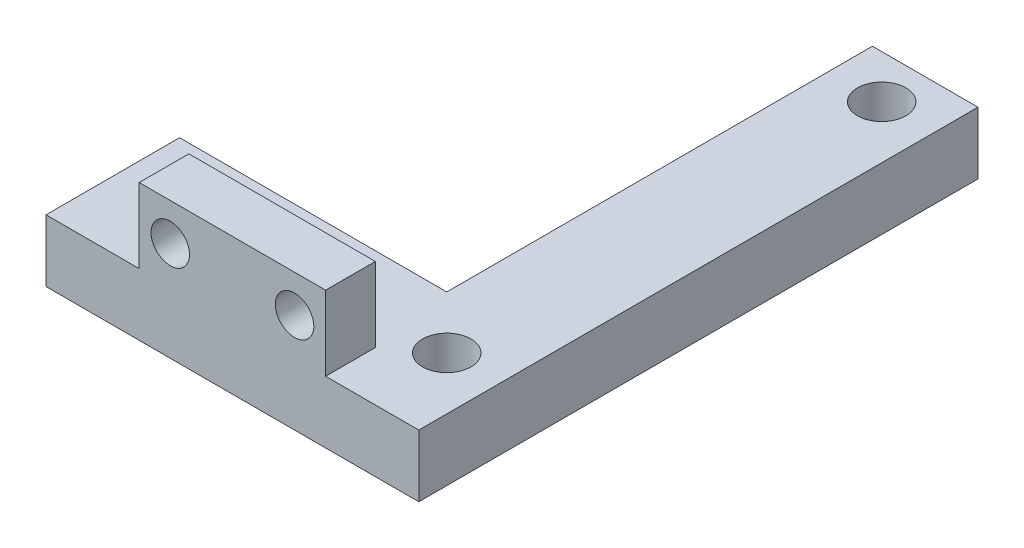
ISO-10303-21;
HEADER;
FILE_DESCRIPTION(('STEP AP214'),'2;1');
FILE_NAME('part.step','',(''),(''),'','','');
FILE_SCHEMA(('AUTOMOTIVE_DESIGN { 1 0 10303 214 1 1 1 1 }'));
ENDSEC;
DATA;
#1=APPLICATION_CONTEXT('core data for automotive mechanical design processes');
#2=APPLICATION_PROTOCOL_DEFINITION('international standard','automotive_design',2000,#1);
#3=PRODUCT_CONTEXT('',#1,'mechanical');
#4=PRODUCT('Part','Part','',(#3));
#5=PRODUCT_RELATED_PRODUCT_CATEGORY('part','',(#4));
#6=PRODUCT_DEFINITION_FORMATION('','',#4);
#7=PRODUCT_DEFINITION_CONTEXT('part definition',#1,'design');
#8=PRODUCT_DEFINITION('design','',#6,#7);
#9=PRODUCT_DEFINITION_SHAPE('','',#8);
#10=(LENGTH_UNIT() NAMED_UNIT(*) SI_UNIT(.MILLI.,.METRE.));
#11=(NAMED_UNIT(*) PLANE_ANGLE_UNIT() SI_UNIT($,.RADIAN.));
#12=(NAMED_UNIT(*) SI_UNIT($,.STERADIAN.) SOLID_ANGLE_UNIT());
#13=UNCERTAINTY_MEASURE_WITH_UNIT(LENGTH_MEASURE(1.E-05),#10,'distance_accuracy_value','');
#14=(GEOMETRIC_REPRESENTATION_CONTEXT(3) GLOBAL_UNCERTAINTY_ASSIGNED_CONTEXT((#13)) GLOBAL_UNIT_ASSIGNED_CONTEXT((#10,
#11,#12)) REPRESENTATION_CONTEXT('',''));
#15=CARTESIAN_POINT('',(0.,0.,0.));
#16=DIRECTION('',(0.,0.,1.));
#17=DIRECTION('',(1.,0.,0.));
#18=AXIS2_PLACEMENT_3D('',#15,#16,#17);
#19=CARTESIAN_POINT('',(-15.,5.,22.5));
#20=DIRECTION('',(1.,0.,0.));
#21=DIRECTION('',(0.,0.,-1.));
#22=AXIS2_PLACEMENT_3D('',#19,#20,#21);
#23=PLANE('',#22);
#24=DIRECTION('',(0.,0.,1.));
#25=VECTOR('',#24,1.);
#26=CARTESIAN_POINT('',(-15.,5.,22.5));
#27=LINE('',#26,#25);
#28=CARTESIAN_POINT('',(-15.,5.,11.75));
#29=VERTEX_POINT('',#28);
#30=CARTESIAN_POINT('',(-15.,5.,22.5));
#31=VERTEX_POINT('',#30);
#32=EDGE_CURVE('E201',#29,#31,#27,.T.);
#33=ORIENTED_EDGE('',*,*,#32,.F.);
#34=DIRECTION('',(0.,1.,0.));
#35=VECTOR('',#34,1.);
#36=CARTESIAN_POINT('',(-15.,0.,11.75));
#37=LINE('',#36,#35);
#38=CARTESIAN_POINT('',(-15.,0.,11.75));
#39=VERTEX_POINT('',#38);
#40=EDGE_CURVE('E170',#39,#29,#37,.T.);
#41=ORIENTED_EDGE('',*,*,#40,.F.);
#42=DIRECTION('',(0.,0.,1.));
#43=VECTOR('',#42,1.);
#44=CARTESIAN_POINT('',(-15.,0.,22.5));
#45=LINE('',#44,#43);
#46=CARTESIAN_POINT('',(-15.,0.,22.5));
#47=VERTEX_POINT('',#46);
#48=EDGE_CURVE('E197',#39,#47,#45,.T.);
#49=ORIENTED_EDGE('',*,*,#48,.T.);
#50=DIRECTION('',(0.,-1.,0.));
#51=VECTOR('',#50,1.);
#52=CARTESIAN_POINT('',(-15.,5.,22.5));
#53=LINE('',#52,#51);
#54=EDGE_CURVE('E11',#31,#47,#53,.T.);
#55=ORIENTED_EDGE('',*,*,#54,.F.);
#56=EDGE_LOOP('',(#33,#41,#49,#55));
#57=FACE_BOUND('',#56,.T.);
#58=ADVANCED_FACE('F43',(#57),#23,.F.);
#59=CARTESIAN_POINT('',(15.,5.,22.5));
#60=DIRECTION('',(0.,0.,-1.));
#61=DIRECTION('',(-1.,0.,0.));
#62=AXIS2_PLACEMENT_3D('',#59,#60,#61);
#63=PLANE('',#62);
#64=CARTESIAN_POINT('',(5.,8.,22.5));
#65=DIRECTION('',(0.,0.,-1.));
#66=DIRECTION('',(-1.,0.,0.));
#67=AXIS2_PLACEMENT_3D('',#64,#65,#66);
#68=CIRCLE('',#67,1.55);
#69=CARTESIAN_POINT('',(3.45,8.,22.5));
#70=VERTEX_POINT('',#69);
#71=EDGE_CURVE('E274',#70,#70,#68,.T.);
#72=ORIENTED_EDGE('',*,*,#71,.T.);
#73=EDGE_LOOP('',(#72));
#74=FACE_BOUND('',#73,.T.);
#75=CARTESIAN_POINT('',(-5.,8.,22.5));
#76=DIRECTION('',(0.,0.,-1.));
#77=DIRECTION('',(-1.,0.,0.));
#78=AXIS2_PLACEMENT_3D('',#75,#76,#77);
#79=CIRCLE('',#78,1.55);
#80=CARTESIAN_POINT('',(-6.55,8.,22.5));
#81=VERTEX_POINT('',#80);
#82=EDGE_CURVE('E278',#81,#81,#79,.T.);
#83=ORIENTED_EDGE('',*,*,#82,.T.);
#84=EDGE_LOOP('',(#83));
#85=FACE_BOUND('',#84,.T.);
#86=DIRECTION('',(1.,0.,0.));
#87=VECTOR('',#86,1.);
#88=CARTESIAN_POINT('',(15.,0.,22.5));
#89=LINE('',#88,#87);
#90=CARTESIAN_POINT('',(15.,0.,22.5));
#91=VERTEX_POINT('',#90);
#92=EDGE_CURVE('E218',#47,#91,#89,.T.);
#93=ORIENTED_EDGE('',*,*,#92,.T.);
#94=DIRECTION('',(0.,-1.,0.));
#95=VECTOR('',#94,1.);
#96=CARTESIAN_POINT('',(15.,5.,22.5));
#97=LINE('',#96,#95);
#98=CARTESIAN_POINT('',(15.,5.,22.5));
#99=VERTEX_POINT('',#98);
#100=EDGE_CURVE('E51',#99,#91,#97,.T.);
#101=ORIENTED_EDGE('',*,*,#100,.F.);
#102=DIRECTION('',(1.,0.,0.));
#103=VECTOR('',#102,1.);
#104=CARTESIAN_POINT('',(15.,5.,22.5));
#105=LINE('',#104,#103);
#106=CARTESIAN_POINT('',(7.5,5.,22.5));
#107=VERTEX_POINT('',#106);
#108=EDGE_CURVE('E143',#107,#99,#105,.T.);
#109=ORIENTED_EDGE('',*,*,#108,.F.);
#110=DIRECTION('',(0.,-1.,0.));
#111=VECTOR('',#110,1.);
#112=CARTESIAN_POINT('',(7.5,11.,22.5));
#113=LINE('',#112,#111);
#114=CARTESIAN_POINT('',(7.5,11.,22.5));
#115=VERTEX_POINT('',#114);
#116=EDGE_CURVE('E123',#115,#107,#113,.T.);
#117=ORIENTED_EDGE('',*,*,#116,.F.);
#118=DIRECTION('',(1.,0.,0.));
#119=VECTOR('',#118,1.);
#120=CARTESIAN_POINT('',(-7.5,11.,22.5));
#121=LINE('',#120,#119);
#122=CARTESIAN_POINT('',(-7.5,11.,22.5));
#123=VERTEX_POINT('',#122);
#124=EDGE_CURVE('E130',#123,#115,#121,.T.);
#125=ORIENTED_EDGE('',*,*,#124,.F.);
#126=DIRECTION('',(0.,-1.,0.));
#127=VECTOR('',#126,1.);
#128=CARTESIAN_POINT('',(-7.5,11.,22.5));
#129=LINE('',#128,#127);
#130=CARTESIAN_POINT('',(-7.5,5.,22.5));
#131=VERTEX_POINT('',#130);
#132=EDGE_CURVE('E259',#123,#131,#129,.T.);
#133=ORIENTED_EDGE('',*,*,#132,.T.);
#134=EDGE_CURVE('E205',#31,#131,#105,.T.);
#135=ORIENTED_EDGE('',*,*,#134,.F.);
#136=ORIENTED_EDGE('',*,*,#54,.T.);
#137=EDGE_LOOP('',(#93,#101,#109,#117,#125,#133,#135,#136));
#138=FACE_BOUND('',#137,.T.);
#139=ADVANCED_FACE('F141',(#74,#85,#138),#63,.F.);
#140=CARTESIAN_POINT('',(15.,5.,22.5));
#141=DIRECTION('',(-1.,0.,0.));
#142=DIRECTION('',(0.,0.,1.));
#143=AXIS2_PLACEMENT_3D('',#140,#141,#142);
#144=PLANE('',#143);
#145=DIRECTION('',(0.,0.,-1.));
#146=VECTOR('',#145,1.);
#147=CARTESIAN_POINT('',(15.,0.,22.5));
#148=LINE('',#147,#146);
#149=CARTESIAN_POINT('',(15.,0.,-22.5));
#150=VERTEX_POINT('',#149);
#151=EDGE_CURVE('E221',#91,#150,#148,.T.);
#152=ORIENTED_EDGE('',*,*,#151,.T.);
#153=DIRECTION('',(0.,-1.,0.));
#154=VECTOR('',#153,1.);
#155=CARTESIAN_POINT('',(15.,5.,-22.5));
#156=LINE('',#155,#154);
#157=CARTESIAN_POINT('',(15.,5.,-22.5));
#158=VERTEX_POINT('',#157);
#159=EDGE_CURVE('E215',#158,#150,#156,.T.);
#160=ORIENTED_EDGE('',*,*,#159,.F.);
#161=DIRECTION('',(0.,0.,-1.));
#162=VECTOR('',#161,1.);
#163=CARTESIAN_POINT('',(15.,5.,22.5));
#164=LINE('',#163,#162);
#165=EDGE_CURVE('E208',#99,#158,#164,.T.);
#166=ORIENTED_EDGE('',*,*,#165,.F.);
#167=ORIENTED_EDGE('',*,*,#100,.T.);
#168=EDGE_LOOP('',(#152,#160,#166,#167));
#169=FACE_BOUND('',#168,.T.);
#170=ADVANCED_FACE('F234',(#169),#144,.F.);
#171=CARTESIAN_POINT('',(15.,5.,-22.5));
#172=DIRECTION('',(0.,0.,1.));
#173=DIRECTION('',(1.,0.,0.));
#174=AXIS2_PLACEMENT_3D('',#171,#172,#173);
#175=PLANE('',#174);
#176=DIRECTION('',(-1.,0.,0.));
#177=VECTOR('',#176,1.);
#178=CARTESIAN_POINT('',(15.,0.,-22.5));
#179=LINE('',#178,#177);
#180=CARTESIAN_POINT('',(6.5,0.,-22.5));
#181=VERTEX_POINT('',#180);
#182=EDGE_CURVE('E204',#150,#181,#179,.T.);
#183=ORIENTED_EDGE('',*,*,#182,.T.);
#184=DIRECTION('',(0.,1.,0.));
#185=VECTOR('',#184,1.);
#186=CARTESIAN_POINT('',(6.5,0.,-22.5));
#187=LINE('',#186,#185);
#188=CARTESIAN_POINT('',(6.5,5.,-22.5));
#189=VERTEX_POINT('',#188);
#190=EDGE_CURVE('E158',#181,#189,#187,.T.);
#191=ORIENTED_EDGE('',*,*,#190,.T.);
#192=DIRECTION('',(-1.,0.,0.));
#193=VECTOR('',#192,1.);
#194=CARTESIAN_POINT('',(15.,5.,-22.5));
#195=LINE('',#194,#193);
#196=EDGE_CURVE('E211',#158,#189,#195,.T.);
#197=ORIENTED_EDGE('',*,*,#196,.F.);
#198=ORIENTED_EDGE('',*,*,#159,.T.);
#199=EDGE_LOOP('',(#183,#191,#197,#198));
#200=FACE_BOUND('',#199,.T.);
#201=ADVANCED_FACE('F242',(#200),#175,.F.);
#202=CARTESIAN_POINT('',(0.,5.,0.));
#203=DIRECTION('',(0.,1.,0.));
#204=DIRECTION('',(0.,0.,1.));
#205=AXIS2_PLACEMENT_3D('',#202,#203,#204);
#206=PLANE('',#205);
#207=DIRECTION('',(0.,0.,1.));
#208=VECTOR('',#207,1.);
#209=CARTESIAN_POINT('',(-7.5,5.,18.5));
#210=LINE('',#209,#208);
#211=CARTESIAN_POINT('',(-7.5,5.,18.5));
#212=VERTEX_POINT('',#211);
#213=EDGE_CURVE('E58',#212,#131,#210,.T.);
#214=ORIENTED_EDGE('',*,*,#213,.F.);
#215=DIRECTION('',(-1.,0.,0.));
#216=VECTOR('',#215,1.);
#217=CARTESIAN_POINT('',(7.5,5.,18.5));
#218=LINE('',#217,#216);
#219=CARTESIAN_POINT('',(7.5,5.,18.5));
#220=VERTEX_POINT('',#219);
#221=EDGE_CURVE('E270',#220,#212,#218,.T.);
#222=ORIENTED_EDGE('',*,*,#221,.F.);
#223=DIRECTION('',(0.,0.,-1.));
#224=VECTOR('',#223,1.);
#225=CARTESIAN_POINT('',(7.5,5.,22.5));
#226=LINE('',#225,#224);
#227=EDGE_CURVE('E64',#107,#220,#226,.T.);
#228=ORIENTED_EDGE('',*,*,#227,.F.);
#229=ORIENTED_EDGE('',*,*,#108,.T.);
#230=ORIENTED_EDGE('',*,*,#165,.T.);
#231=ORIENTED_EDGE('',*,*,#196,.T.);
#232=DIRECTION('',(0.,0.,-1.));
#233=VECTOR('',#232,1.);
#234=CARTESIAN_POINT('',(6.5,5.,11.75));
#235=LINE('',#234,#233);
#236=CARTESIAN_POINT('',(6.5,5.,11.75));
#237=VERTEX_POINT('',#236);
#238=EDGE_CURVE('E180',#237,#189,#235,.T.);
#239=ORIENTED_EDGE('',*,*,#238,.F.);
#240=DIRECTION('',(1.,0.,0.));
#241=VECTOR('',#240,1.);
#242=CARTESIAN_POINT('',(-15.,5.,11.75));
#243=LINE('',#242,#241);
#244=EDGE_CURVE('E169',#29,#237,#243,.T.);
#245=ORIENTED_EDGE('',*,*,#244,.F.);
#246=ORIENTED_EDGE('',*,*,#32,.T.);
#247=ORIENTED_EDGE('',*,*,#134,.T.);
#248=EDGE_LOOP('',(#214,#222,#228,#229,#230,#231,#239,#245,#246,#247));
#249=FACE_BOUND('',#248,.T.);
#250=CARTESIAN_POINT('',(10.75,5.,16.));
#251=DIRECTION('',(0.,1.,0.));
#252=DIRECTION('',(0.,0.,1.));
#253=AXIS2_PLACEMENT_3D('',#250,#251,#252);
#254=CIRCLE('',#253,1.95);
#255=CARTESIAN_POINT('',(10.75,5.,17.95));
#256=VERTEX_POINT('',#255);
#257=EDGE_CURVE('E160',#256,#256,#254,.T.);
#258=ORIENTED_EDGE('',*,*,#257,.F.);
#259=EDGE_LOOP('',(#258));
#260=FACE_BOUND('',#259,.T.);
#261=CARTESIAN_POINT('',(-10.75,5.,16.));
#262=DIRECTION('',(0.,1.,0.));
#263=DIRECTION('',(0.,0.,1.));
#264=AXIS2_PLACEMENT_3D('',#261,#262,#263);
#265=CIRCLE('',#264,1.95);
#266=CARTESIAN_POINT('',(-10.75,5.,17.95));
#267=VERTEX_POINT('',#266);
#268=EDGE_CURVE('E150',#267,#267,#265,.T.);
#269=ORIENTED_EDGE('',*,*,#268,.F.);
#270=EDGE_LOOP('',(#269));
#271=FACE_BOUND('',#270,.T.);
#272=CARTESIAN_POINT('',(10.75,5.,-19.));
#273=DIRECTION('',(0.,1.,0.));
#274=DIRECTION('',(0.,0.,1.));
#275=AXIS2_PLACEMENT_3D('',#272,#273,#274);
#276=CIRCLE('',#275,1.95);
#277=CARTESIAN_POINT('',(10.75,5.,-17.05));
#278=VERTEX_POINT('',#277);
#279=EDGE_CURVE('E164',#278,#278,#276,.T.);
#280=ORIENTED_EDGE('',*,*,#279,.F.);
#281=EDGE_LOOP('',(#280));
#282=FACE_BOUND('',#281,.T.);
#283=ADVANCED_FACE('F245',(#249,#260,#271,#282),#206,.T.);
#284=CARTESIAN_POINT('',(0.,0.,0.));
#285=DIRECTION('',(0.,1.,0.));
#286=DIRECTION('',(0.,0.,1.));
#287=AXIS2_PLACEMENT_3D('',#284,#285,#286);
#288=PLANE('',#287);
#289=CARTESIAN_POINT('',(10.75,0.,16.));
#290=DIRECTION('',(0.,1.,0.));
#291=DIRECTION('',(0.,0.,1.));
#292=AXIS2_PLACEMENT_3D('',#289,#290,#291);
#293=CIRCLE('',#292,1.95);
#294=CARTESIAN_POINT('',(10.75,0.,17.95));
#295=VERTEX_POINT('',#294);
#296=EDGE_CURVE('E165',#295,#295,#293,.T.);
#297=ORIENTED_EDGE('',*,*,#296,.T.);
#298=EDGE_LOOP('',(#297));
#299=FACE_BOUND('',#298,.T.);
#300=CARTESIAN_POINT('',(-10.75,0.,16.));
#301=DIRECTION('',(0.,1.,0.));
#302=DIRECTION('',(0.,0.,1.));
#303=AXIS2_PLACEMENT_3D('',#300,#301,#302);
#304=CIRCLE('',#303,1.95);
#305=CARTESIAN_POINT('',(-10.75,0.,17.95));
#306=VERTEX_POINT('',#305);
#307=EDGE_CURVE('E145',#306,#306,#304,.T.);
#308=ORIENTED_EDGE('',*,*,#307,.T.);
#309=EDGE_LOOP('',(#308));
#310=FACE_BOUND('',#309,.T.);
#311=CARTESIAN_POINT('',(10.75,0.,-19.));
#312=DIRECTION('',(0.,1.,0.));
#313=DIRECTION('',(0.,0.,1.));
#314=AXIS2_PLACEMENT_3D('',#311,#312,#313);
#315=CIRCLE('',#314,1.95);
#316=CARTESIAN_POINT('',(10.75,0.,-17.05));
#317=VERTEX_POINT('',#316);
#318=EDGE_CURVE('E193',#317,#317,#315,.T.);
#319=ORIENTED_EDGE('',*,*,#318,.T.);
#320=EDGE_LOOP('',(#319));
#321=FACE_BOUND('',#320,.T.);
#322=DIRECTION('',(1.,0.,0.));
#323=VECTOR('',#322,1.);
#324=CARTESIAN_POINT('',(-15.,0.,11.75));
#325=LINE('',#324,#323);
#326=CARTESIAN_POINT('',(6.5,0.,11.75));
#327=VERTEX_POINT('',#326);
#328=EDGE_CURVE('E183',#39,#327,#325,.T.);
#329=ORIENTED_EDGE('',*,*,#328,.T.);
#330=DIRECTION('',(0.,0.,-1.));
#331=VECTOR('',#330,1.);
#332=CARTESIAN_POINT('',(6.5,0.,11.75));
#333=LINE('',#332,#331);
#334=EDGE_CURVE('E173',#327,#181,#333,.T.);
#335=ORIENTED_EDGE('',*,*,#334,.T.);
#336=ORIENTED_EDGE('',*,*,#182,.F.);
#337=ORIENTED_EDGE('',*,*,#151,.F.);
#338=ORIENTED_EDGE('',*,*,#92,.F.);
#339=ORIENTED_EDGE('',*,*,#48,.F.);
#340=EDGE_LOOP('',(#329,#335,#336,#337,#338,#339));
#341=FACE_BOUND('',#340,.T.);
#342=ADVANCED_FACE('F239',(#299,#310,#321,#341),#288,.F.);
#343=CARTESIAN_POINT('',(10.75,0.,-19.));
#344=DIRECTION('',(0.,1.,0.));
#345=DIRECTION('',(0.,0.,1.));
#346=AXIS2_PLACEMENT_3D('',#343,#344,#345);
#347=CYLINDRICAL_SURFACE('',#346,1.95);
#348=ORIENTED_EDGE('',*,*,#318,.F.);
#349=EDGE_LOOP('',(#348));
#350=FACE_BOUND('',#349,.T.);
#351=ORIENTED_EDGE('',*,*,#279,.T.);
#352=EDGE_LOOP('',(#351));
#353=FACE_BOUND('',#352,.T.);
#354=ADVANCED_FACE('F330',(#350,#353),#347,.F.);
#355=CARTESIAN_POINT('',(-10.75,0.,16.));
#356=DIRECTION('',(0.,1.,0.));
#357=DIRECTION('',(0.,0.,1.));
#358=AXIS2_PLACEMENT_3D('',#355,#356,#357);
#359=CYLINDRICAL_SURFACE('',#358,1.95);
#360=ORIENTED_EDGE('',*,*,#307,.F.);
#361=EDGE_LOOP('',(#360));
#362=FACE_BOUND('',#361,.T.);
#363=ORIENTED_EDGE('',*,*,#268,.T.);
#364=EDGE_LOOP('',(#363));
#365=FACE_BOUND('',#364,.T.);
#366=ADVANCED_FACE('F336',(#362,#365),#359,.F.);
#367=CARTESIAN_POINT('',(6.5,0.,11.75));
#368=DIRECTION('',(1.,0.,0.));
#369=DIRECTION('',(0.,0.,-1.));
#370=AXIS2_PLACEMENT_3D('',#367,#368,#369);
#371=PLANE('',#370);
#372=ORIENTED_EDGE('',*,*,#238,.T.);
#373=ORIENTED_EDGE('',*,*,#190,.F.);
#374=ORIENTED_EDGE('',*,*,#334,.F.);
#375=DIRECTION('',(0.,1.,0.));
#376=VECTOR('',#375,1.);
#377=CARTESIAN_POINT('',(6.5,0.,11.75));
#378=LINE('',#377,#376);
#379=EDGE_CURVE('E174',#327,#237,#378,.T.);
#380=ORIENTED_EDGE('',*,*,#379,.T.);
#381=EDGE_LOOP('',(#372,#373,#374,#380));
#382=FACE_BOUND('',#381,.T.);
#383=ADVANCED_FACE('F251',(#382),#371,.F.);
#384=CARTESIAN_POINT('',(-15.,0.,11.75));
#385=DIRECTION('',(0.,0.,1.));
#386=DIRECTION('',(1.,0.,0.));
#387=AXIS2_PLACEMENT_3D('',#384,#385,#386);
#388=PLANE('',#387);
#389=ORIENTED_EDGE('',*,*,#244,.T.);
#390=ORIENTED_EDGE('',*,*,#379,.F.);
#391=ORIENTED_EDGE('',*,*,#328,.F.);
#392=ORIENTED_EDGE('',*,*,#40,.T.);
#393=EDGE_LOOP('',(#389,#390,#391,#392));
#394=FACE_BOUND('',#393,.T.);
#395=ADVANCED_FACE('F254',(#394),#388,.F.);
#396=CARTESIAN_POINT('',(10.75,0.,16.));
#397=DIRECTION('',(0.,1.,0.));
#398=DIRECTION('',(0.,0.,1.));
#399=AXIS2_PLACEMENT_3D('',#396,#397,#398);
#400=CYLINDRICAL_SURFACE('',#399,1.95);
#401=ORIENTED_EDGE('',*,*,#296,.F.);
#402=EDGE_LOOP('',(#401));
#403=FACE_BOUND('',#402,.T.);
#404=ORIENTED_EDGE('',*,*,#257,.T.);
#405=EDGE_LOOP('',(#404));
#406=FACE_BOUND('',#405,.T.);
#407=ADVANCED_FACE('F342',(#403,#406),#400,.F.);
#408=CARTESIAN_POINT('',(7.5,11.,22.5));
#409=DIRECTION('',(-1.,0.,0.));
#410=DIRECTION('',(0.,0.,1.));
#411=AXIS2_PLACEMENT_3D('',#408,#409,#410);
#412=PLANE('',#411);
#413=ORIENTED_EDGE('',*,*,#227,.T.);
#414=DIRECTION('',(0.,-1.,0.));
#415=VECTOR('',#414,1.);
#416=CARTESIAN_POINT('',(7.5,11.,18.5));
#417=LINE('',#416,#415);
#418=CARTESIAN_POINT('',(7.5,11.,18.5));
#419=VERTEX_POINT('',#418);
#420=EDGE_CURVE('E125',#419,#220,#417,.T.);
#421=ORIENTED_EDGE('',*,*,#420,.F.);
#422=DIRECTION('',(0.,0.,-1.));
#423=VECTOR('',#422,1.);
#424=CARTESIAN_POINT('',(7.5,11.,22.5));
#425=LINE('',#424,#423);
#426=EDGE_CURVE('E119',#115,#419,#425,.T.);
#427=ORIENTED_EDGE('',*,*,#426,.F.);
#428=ORIENTED_EDGE('',*,*,#116,.T.);
#429=EDGE_LOOP('',(#413,#421,#427,#428));
#430=FACE_BOUND('',#429,.T.);
#431=ADVANCED_FACE('F121',(#430),#412,.F.);
#432=CARTESIAN_POINT('',(7.5,11.,18.5));
#433=DIRECTION('',(0.,0.,1.));
#434=DIRECTION('',(1.,0.,0.));
#435=AXIS2_PLACEMENT_3D('',#432,#433,#434);
#436=PLANE('',#435);
#437=CARTESIAN_POINT('',(5.,8.,18.5));
#438=DIRECTION('',(0.,0.,-1.));
#439=DIRECTION('',(-1.,0.,0.));
#440=AXIS2_PLACEMENT_3D('',#437,#438,#439);
#441=CIRCLE('',#440,1.55);
#442=CARTESIAN_POINT('',(3.45,8.,18.5));
#443=VERTEX_POINT('',#442);
#444=EDGE_CURVE('E286',#443,#443,#441,.T.);
#445=ORIENTED_EDGE('',*,*,#444,.F.);
#446=EDGE_LOOP('',(#445));
#447=FACE_BOUND('',#446,.T.);
#448=CARTESIAN_POINT('',(-5.,8.,18.5));
#449=DIRECTION('',(0.,0.,-1.));
#450=DIRECTION('',(-1.,0.,0.));
#451=AXIS2_PLACEMENT_3D('',#448,#449,#450);
#452=CIRCLE('',#451,1.55);
#453=CARTESIAN_POINT('',(-6.55,8.,18.5));
#454=VERTEX_POINT('',#453);
#455=EDGE_CURVE('E282',#454,#454,#452,.T.);
#456=ORIENTED_EDGE('',*,*,#455,.F.);
#457=EDGE_LOOP('',(#456));
#458=FACE_BOUND('',#457,.T.);
#459=ORIENTED_EDGE('',*,*,#221,.T.);
#460=DIRECTION('',(0.,-1.,0.));
#461=VECTOR('',#460,1.);
#462=CARTESIAN_POINT('',(-7.5,11.,18.5));
#463=LINE('',#462,#461);
#464=CARTESIAN_POINT('',(-7.5,11.,18.5));
#465=VERTEX_POINT('',#464);
#466=EDGE_CURVE('E152',#465,#212,#463,.T.);
#467=ORIENTED_EDGE('',*,*,#466,.F.);
#468=DIRECTION('',(-1.,0.,0.));
#469=VECTOR('',#468,1.);
#470=CARTESIAN_POINT('',(7.5,11.,18.5));
#471=LINE('',#470,#469);
#472=EDGE_CURVE('E129',#419,#465,#471,.T.);
#473=ORIENTED_EDGE('',*,*,#472,.F.);
#474=ORIENTED_EDGE('',*,*,#420,.T.);
#475=EDGE_LOOP('',(#459,#467,#473,#474));
#476=FACE_BOUND('',#475,.T.);
#477=ADVANCED_FACE('F303',(#447,#458,#476),#436,.F.);
#478=CARTESIAN_POINT('',(-7.5,11.,18.5));
#479=DIRECTION('',(1.,0.,0.));
#480=DIRECTION('',(0.,0.,-1.));
#481=AXIS2_PLACEMENT_3D('',#478,#479,#480);
#482=PLANE('',#481);
#483=ORIENTED_EDGE('',*,*,#213,.T.);
#484=ORIENTED_EDGE('',*,*,#132,.F.);
#485=DIRECTION('',(0.,0.,1.));
#486=VECTOR('',#485,1.);
#487=CARTESIAN_POINT('',(-7.5,11.,18.5));
#488=LINE('',#487,#486);
#489=EDGE_CURVE('E135',#465,#123,#488,.T.);
#490=ORIENTED_EDGE('',*,*,#489,.F.);
#491=ORIENTED_EDGE('',*,*,#466,.T.);
#492=EDGE_LOOP('',(#483,#484,#490,#491));
#493=FACE_BOUND('',#492,.T.);
#494=ADVANCED_FACE('F306',(#493),#482,.F.);
#495=CARTESIAN_POINT('',(0.,11.,0.));
#496=DIRECTION('',(0.,1.,0.));
#497=DIRECTION('',(0.,0.,1.));
#498=AXIS2_PLACEMENT_3D('',#495,#496,#497);
#499=PLANE('',#498);
#500=ORIENTED_EDGE('',*,*,#124,.T.);
#501=ORIENTED_EDGE('',*,*,#426,.T.);
#502=ORIENTED_EDGE('',*,*,#472,.T.);
#503=ORIENTED_EDGE('',*,*,#489,.T.);
#504=EDGE_LOOP('',(#500,#501,#502,#503));
#505=FACE_BOUND('',#504,.T.);
#506=ADVANCED_FACE('F133',(#505),#499,.T.);
#507=CARTESIAN_POINT('',(-5.,8.,22.5));
#508=DIRECTION('',(0.,0.,-1.));
#509=DIRECTION('',(-1.,0.,0.));
#510=AXIS2_PLACEMENT_3D('',#507,#508,#509);
#511=CYLINDRICAL_SURFACE('',#510,1.55);
#512=ORIENTED_EDGE('',*,*,#82,.F.);
#513=EDGE_LOOP('',(#512));
#514=FACE_BOUND('',#513,.T.);
#515=ORIENTED_EDGE('',*,*,#455,.T.);
#516=EDGE_LOOP('',(#515));
#517=FACE_BOUND('',#516,.T.);
#518=ADVANCED_FACE('F299',(#514,#517),#511,.F.);
#519=CARTESIAN_POINT('',(5.,8.,22.5));
#520=DIRECTION('',(0.,0.,-1.));
#521=DIRECTION('',(-1.,0.,0.));
#522=AXIS2_PLACEMENT_3D('',#519,#520,#521);
#523=CYLINDRICAL_SURFACE('',#522,1.55);
#524=ORIENTED_EDGE('',*,*,#71,.F.);
#525=EDGE_LOOP('',(#524));
#526=FACE_BOUND('',#525,.T.);
#527=ORIENTED_EDGE('',*,*,#444,.T.);
#528=EDGE_LOOP('',(#527));
#529=FACE_BOUND('',#528,.T.);
#530=ADVANCED_FACE('F296',(#526,#529),#523,.F.);
#531=CLOSED_SHELL('',(#58,#139,#170,#201,#283,#342,#354,#366,#383,#395,#407,#431,#477,#494,#506,
#518,#530));
#532=MANIFOLD_SOLID_BREP('B2',#531);
#533=ADVANCED_BREP_SHAPE_REPRESENTATION('',(#18,#532),#14);
#534=SHAPE_DEFINITION_REPRESENTATION(#9,#533);
ENDSEC;
END-ISO-10303-21;
